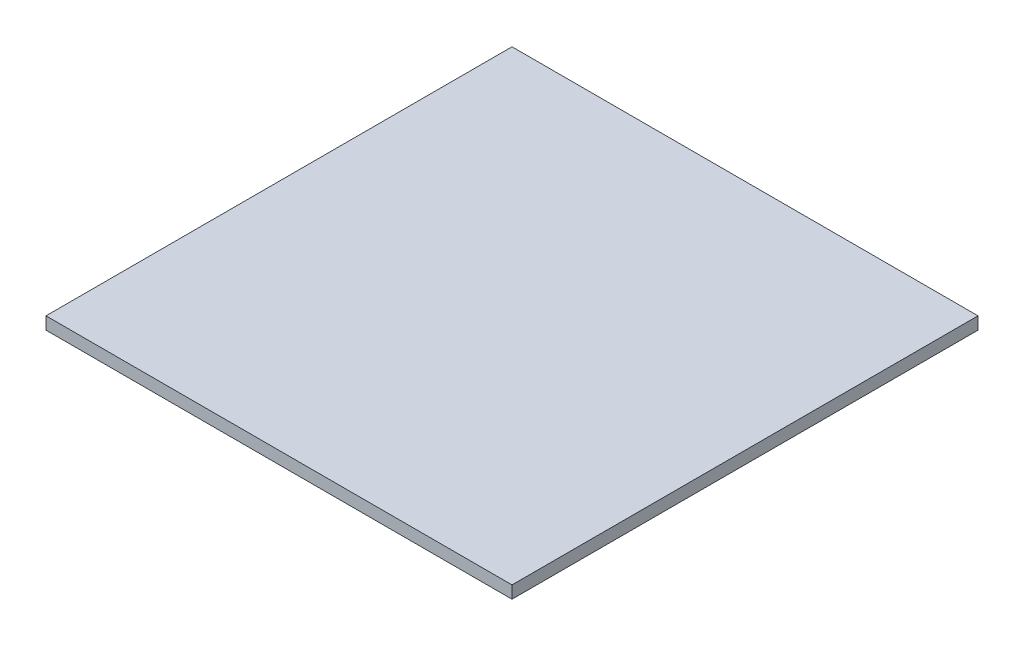
ISO-10303-21;
HEADER;
FILE_DESCRIPTION(('STEP AP214'),'2;1');
FILE_NAME('part.step','',(''),(''),'','','');
FILE_SCHEMA(('AUTOMOTIVE_DESIGN { 1 0 10303 214 1 1 1 1 }'));
ENDSEC;
DATA;
#1=APPLICATION_CONTEXT('core data for automotive mechanical design processes');
#2=APPLICATION_PROTOCOL_DEFINITION('international standard','automotive_design',2000,#1);
#3=PRODUCT_CONTEXT('',#1,'mechanical');
#4=PRODUCT('Part','Part','',(#3));
#5=PRODUCT_RELATED_PRODUCT_CATEGORY('part','',(#4));
#6=PRODUCT_DEFINITION_FORMATION('','',#4);
#7=PRODUCT_DEFINITION_CONTEXT('part definition',#1,'design');
#8=PRODUCT_DEFINITION('design','',#6,#7);
#9=PRODUCT_DEFINITION_SHAPE('','',#8);
#10=(LENGTH_UNIT() NAMED_UNIT(*) SI_UNIT(.MILLI.,.METRE.));
#11=(NAMED_UNIT(*) PLANE_ANGLE_UNIT() SI_UNIT($,.RADIAN.));
#12=(NAMED_UNIT(*) SI_UNIT($,.STERADIAN.) SOLID_ANGLE_UNIT());
#13=UNCERTAINTY_MEASURE_WITH_UNIT(LENGTH_MEASURE(1.E-05),#10,'distance_accuracy_value','');
#14=(GEOMETRIC_REPRESENTATION_CONTEXT(3) GLOBAL_UNCERTAINTY_ASSIGNED_CONTEXT((#13)) GLOBAL_UNIT_ASSIGNED_CONTEXT((#10,
#11,#12)) REPRESENTATION_CONTEXT('',''));
#15=CARTESIAN_POINT('',(0.,0.,0.));
#16=DIRECTION('',(0.,0.,1.));
#17=DIRECTION('',(1.,0.,0.));
#18=AXIS2_PLACEMENT_3D('',#15,#16,#17);
#19=CARTESIAN_POINT('',(0.,4.,-345.));
#20=DIRECTION('',(0.,0.,1.));
#21=DIRECTION('',(1.,0.,0.));
#22=AXIS2_PLACEMENT_3D('',#19,#20,#21);
#23=PLANE('',#22);
#24=DIRECTION('',(0.,1.,0.));
#25=VECTOR('',#24,1.);
#26=CARTESIAN_POINT('',(200.,4.,-345.));
#27=LINE('',#26,#25);
#28=CARTESIAN_POINT('',(200.,4.,-345.));
#29=VERTEX_POINT('',#28);
#30=CARTESIAN_POINT('',(200.,8.,-345.));
#31=VERTEX_POINT('',#30);
#32=EDGE_CURVE('E11',#29,#31,#27,.T.);
#33=ORIENTED_EDGE('',*,*,#32,.F.);
#34=DIRECTION('',(1.,0.,0.));
#35=VECTOR('',#34,1.);
#36=CARTESIAN_POINT('',(0.,4.,-345.));
#37=LINE('',#36,#35);
#38=CARTESIAN_POINT('',(50.,4.,-345.));
#39=VERTEX_POINT('',#38);
#40=EDGE_CURVE('E89',#29,#39,#37,.F.);
#41=ORIENTED_EDGE('',*,*,#40,.T.);
#42=DIRECTION('',(0.,1.,0.));
#43=VECTOR('',#42,1.);
#44=CARTESIAN_POINT('',(50.,4.,-345.));
#45=LINE('',#44,#43);
#46=CARTESIAN_POINT('',(50.,8.,-345.));
#47=VERTEX_POINT('',#46);
#48=EDGE_CURVE('E44',#39,#47,#45,.T.);
#49=ORIENTED_EDGE('',*,*,#48,.T.);
#50=DIRECTION('',(1.,0.,0.));
#51=VECTOR('',#50,1.);
#52=CARTESIAN_POINT('',(0.,8.,-345.));
#53=LINE('',#52,#51);
#54=EDGE_CURVE('E102',#31,#47,#53,.F.);
#55=ORIENTED_EDGE('',*,*,#54,.F.);
#56=EDGE_LOOP('',(#33,#41,#49,#55));
#57=FACE_BOUND('',#56,.T.);
#58=ADVANCED_FACE('F34',(#57),#23,.F.);
#59=CARTESIAN_POINT('',(50.,4.,0.));
#60=DIRECTION('',(-1.,0.,0.));
#61=DIRECTION('',(0.,0.,1.));
#62=AXIS2_PLACEMENT_3D('',#59,#60,#61);
#63=PLANE('',#62);
#64=ORIENTED_EDGE('',*,*,#48,.F.);
#65=DIRECTION('',(0.,0.,1.));
#66=VECTOR('',#65,1.);
#67=CARTESIAN_POINT('',(50.,4.,0.));
#68=LINE('',#67,#66);
#69=CARTESIAN_POINT('',(50.,4.,-195.));
#70=VERTEX_POINT('',#69);
#71=EDGE_CURVE('E96',#39,#70,#68,.T.);
#72=ORIENTED_EDGE('',*,*,#71,.T.);
#73=DIRECTION('',(0.,1.,0.));
#74=VECTOR('',#73,1.);
#75=CARTESIAN_POINT('',(50.,4.,-195.));
#76=LINE('',#75,#74);
#77=CARTESIAN_POINT('',(50.,8.,-195.));
#78=VERTEX_POINT('',#77);
#79=EDGE_CURVE('E52',#70,#78,#76,.T.);
#80=ORIENTED_EDGE('',*,*,#79,.T.);
#81=DIRECTION('',(0.,0.,1.));
#82=VECTOR('',#81,1.);
#83=CARTESIAN_POINT('',(50.,8.,0.));
#84=LINE('',#83,#82);
#85=EDGE_CURVE('E83',#47,#78,#84,.T.);
#86=ORIENTED_EDGE('',*,*,#85,.F.);
#87=EDGE_LOOP('',(#64,#72,#80,#86));
#88=FACE_BOUND('',#87,.T.);
#89=ADVANCED_FACE('F106',(#88),#63,.T.);
#90=CARTESIAN_POINT('',(0.,4.,-195.));
#91=DIRECTION('',(0.,0.,1.));
#92=DIRECTION('',(1.,0.,0.));
#93=AXIS2_PLACEMENT_3D('',#90,#91,#92);
#94=PLANE('',#93);
#95=ORIENTED_EDGE('',*,*,#79,.F.);
#96=DIRECTION('',(1.,0.,0.));
#97=VECTOR('',#96,1.);
#98=CARTESIAN_POINT('',(0.,4.,-195.));
#99=LINE('',#98,#97);
#100=CARTESIAN_POINT('',(200.,4.,-195.));
#101=VERTEX_POINT('',#100);
#102=EDGE_CURVE('E88',#101,#70,#99,.F.);
#103=ORIENTED_EDGE('',*,*,#102,.F.);
#104=DIRECTION('',(0.,1.,0.));
#105=VECTOR('',#104,1.);
#106=CARTESIAN_POINT('',(200.,4.,-195.));
#107=LINE('',#106,#105);
#108=CARTESIAN_POINT('',(200.,8.,-195.));
#109=VERTEX_POINT('',#108);
#110=EDGE_CURVE('E38',#101,#109,#107,.T.);
#111=ORIENTED_EDGE('',*,*,#110,.T.);
#112=DIRECTION('',(1.,0.,0.));
#113=VECTOR('',#112,1.);
#114=CARTESIAN_POINT('',(0.,8.,-195.));
#115=LINE('',#114,#113);
#116=EDGE_CURVE('E98',#109,#78,#115,.F.);
#117=ORIENTED_EDGE('',*,*,#116,.T.);
#118=EDGE_LOOP('',(#95,#103,#111,#117));
#119=FACE_BOUND('',#118,.T.);
#120=ADVANCED_FACE('F91',(#119),#94,.T.);
#121=CARTESIAN_POINT('',(200.,4.,0.));
#122=DIRECTION('',(-1.,0.,0.));
#123=DIRECTION('',(0.,0.,1.));
#124=AXIS2_PLACEMENT_3D('',#121,#122,#123);
#125=PLANE('',#124);
#126=DIRECTION('',(0.,0.,1.));
#127=VECTOR('',#126,1.);
#128=CARTESIAN_POINT('',(200.,4.,0.));
#129=LINE('',#128,#127);
#130=EDGE_CURVE('E77',#101,#29,#129,.F.);
#131=ORIENTED_EDGE('',*,*,#130,.T.);
#132=ORIENTED_EDGE('',*,*,#32,.T.);
#133=DIRECTION('',(0.,0.,1.));
#134=VECTOR('',#133,1.);
#135=CARTESIAN_POINT('',(200.,8.,0.));
#136=LINE('',#135,#134);
#137=EDGE_CURVE('E79',#109,#31,#136,.F.);
#138=ORIENTED_EDGE('',*,*,#137,.F.);
#139=ORIENTED_EDGE('',*,*,#110,.F.);
#140=EDGE_LOOP('',(#131,#132,#138,#139));
#141=FACE_BOUND('',#140,.T.);
#142=ADVANCED_FACE('F36',(#141),#125,.F.);
#143=CARTESIAN_POINT('',(0.,8.,0.));
#144=DIRECTION('',(0.,1.,0.));
#145=DIRECTION('',(0.,0.,1.));
#146=AXIS2_PLACEMENT_3D('',#143,#144,#145);
#147=PLANE('',#146);
#148=ORIENTED_EDGE('',*,*,#116,.F.);
#149=ORIENTED_EDGE('',*,*,#137,.T.);
#150=ORIENTED_EDGE('',*,*,#54,.T.);
#151=ORIENTED_EDGE('',*,*,#85,.T.);
#152=EDGE_LOOP('',(#148,#149,#150,#151));
#153=FACE_BOUND('',#152,.T.);
#154=ADVANCED_FACE('F105',(#153),#147,.T.);
#155=CARTESIAN_POINT('',(0.,4.,0.));
#156=DIRECTION('',(0.,1.,0.));
#157=DIRECTION('',(0.,0.,1.));
#158=AXIS2_PLACEMENT_3D('',#155,#156,#157);
#159=PLANE('',#158);
#160=ORIENTED_EDGE('',*,*,#102,.T.);
#161=ORIENTED_EDGE('',*,*,#71,.F.);
#162=ORIENTED_EDGE('',*,*,#40,.F.);
#163=ORIENTED_EDGE('',*,*,#130,.F.);
#164=EDGE_LOOP('',(#160,#161,#162,#163));
#165=FACE_BOUND('',#164,.T.);
#166=ADVANCED_FACE('F86',(#165),#159,.F.);
#167=CLOSED_SHELL('',(#58,#89,#120,#142,#154,#166));
#168=MANIFOLD_SOLID_BREP('B2',#167);
#169=ADVANCED_BREP_SHAPE_REPRESENTATION('',(#18,#168),#14);
#170=SHAPE_DEFINITION_REPRESENTATION(#9,#169);
ENDSEC;
END-ISO-10303-21;
